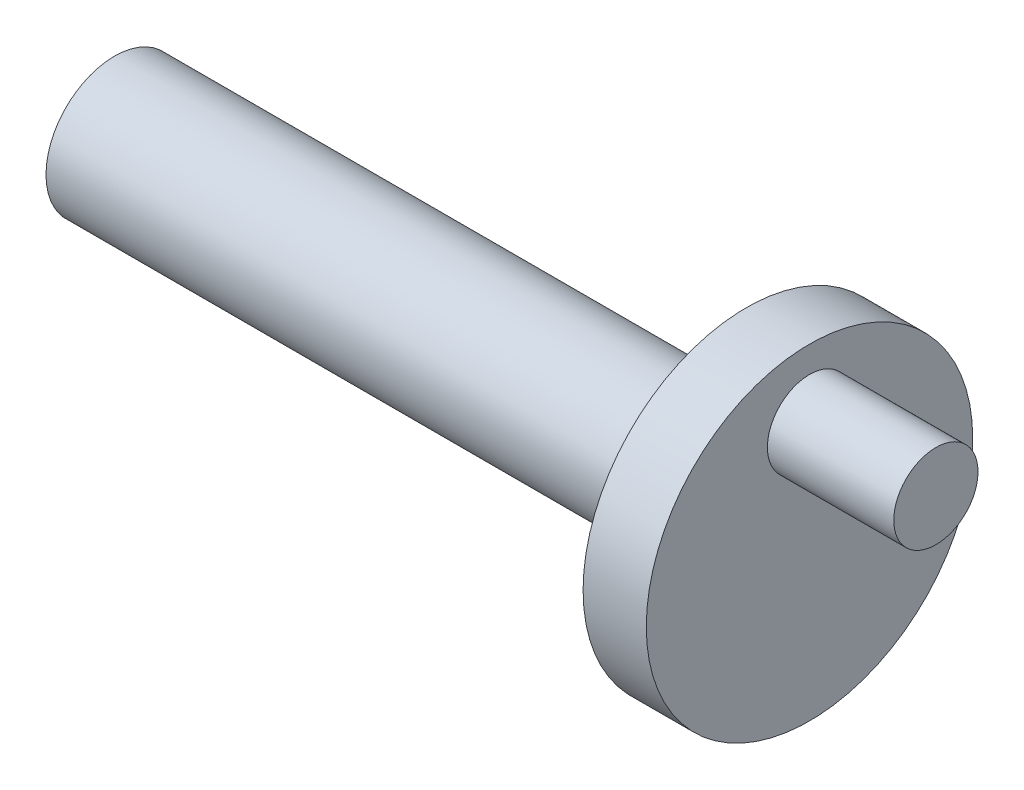
ISO-10303-21;
HEADER;
FILE_DESCRIPTION(('STEP AP214'),'2;1');
FILE_NAME('part.step','',(''),(''),'','','');
FILE_SCHEMA(('AUTOMOTIVE_DESIGN { 1 0 10303 214 1 1 1 1 }'));
ENDSEC;
DATA;
#1=APPLICATION_CONTEXT('core data for automotive mechanical design processes');
#2=APPLICATION_PROTOCOL_DEFINITION('international standard','automotive_design',2000,#1);
#3=PRODUCT_CONTEXT('',#1,'mechanical');
#4=PRODUCT('Part','Part','',(#3));
#5=PRODUCT_RELATED_PRODUCT_CATEGORY('part','',(#4));
#6=PRODUCT_DEFINITION_FORMATION('','',#4);
#7=PRODUCT_DEFINITION_CONTEXT('part definition',#1,'design');
#8=PRODUCT_DEFINITION('design','',#6,#7);
#9=PRODUCT_DEFINITION_SHAPE('','',#8);
#10=(LENGTH_UNIT() NAMED_UNIT(*) SI_UNIT(.MILLI.,.METRE.));
#11=(NAMED_UNIT(*) PLANE_ANGLE_UNIT() SI_UNIT($,.RADIAN.));
#12=(NAMED_UNIT(*) SI_UNIT($,.STERADIAN.) SOLID_ANGLE_UNIT());
#13=UNCERTAINTY_MEASURE_WITH_UNIT(LENGTH_MEASURE(1.E-05),#10,'distance_accuracy_value','');
#14=(GEOMETRIC_REPRESENTATION_CONTEXT(3) GLOBAL_UNCERTAINTY_ASSIGNED_CONTEXT((#13)) GLOBAL_UNIT_ASSIGNED_CONTEXT((#10,
#11,#12)) REPRESENTATION_CONTEXT('',''));
#15=CARTESIAN_POINT('',(0.,0.,0.));
#16=DIRECTION('',(0.,0.,1.));
#17=DIRECTION('',(1.,0.,0.));
#18=AXIS2_PLACEMENT_3D('',#15,#16,#17);
#19=CARTESIAN_POINT('',(6.,0.,0.));
#20=DIRECTION('',(-1.,0.,0.));
#21=DIRECTION('',(0.,0.,1.));
#22=AXIS2_PLACEMENT_3D('',#19,#20,#21);
#23=CYLINDRICAL_SURFACE('',#22,15.5);
#24=CARTESIAN_POINT('',(6.,0.,0.));
#25=DIRECTION('',(1.,0.,0.));
#26=DIRECTION('',(0.,0.,-1.));
#27=AXIS2_PLACEMENT_3D('',#24,#25,#26);
#28=CIRCLE('',#27,15.5);
#29=CARTESIAN_POINT('',(6.,0.,-15.5));
#30=VERTEX_POINT('',#29);
#31=EDGE_CURVE('E59',#30,#30,#28,.T.);
#32=ORIENTED_EDGE('',*,*,#31,.F.);
#33=EDGE_LOOP('',(#32));
#34=FACE_BOUND('',#33,.T.);
#35=CARTESIAN_POINT('',(0.,0.,0.));
#36=DIRECTION('',(1.,0.,0.));
#37=DIRECTION('',(0.,0.,-1.));
#38=AXIS2_PLACEMENT_3D('',#35,#36,#37);
#39=CIRCLE('',#38,15.5);
#40=CARTESIAN_POINT('',(0.,0.,-15.5));
#41=VERTEX_POINT('',#40);
#42=EDGE_CURVE('E63',#41,#41,#39,.T.);
#43=ORIENTED_EDGE('',*,*,#42,.T.);
#44=EDGE_LOOP('',(#43));
#45=FACE_BOUND('',#44,.T.);
#46=ADVANCED_FACE('F48',(#34,#45),#23,.T.);
#47=CARTESIAN_POINT('',(6.,0.,0.));
#48=DIRECTION('',(1.,0.,0.));
#49=DIRECTION('',(0.,0.,-1.));
#50=AXIS2_PLACEMENT_3D('',#47,#48,#49);
#51=PLANE('',#50);
#52=CARTESIAN_POINT('',(6.,9.,0.));
#53=DIRECTION('',(1.,0.,0.));
#54=DIRECTION('',(0.,0.,-1.));
#55=AXIS2_PLACEMENT_3D('',#52,#53,#54);
#56=CIRCLE('',#55,4.);
#57=CARTESIAN_POINT('',(6.,9.,-4.));
#58=VERTEX_POINT('',#57);
#59=EDGE_CURVE('E72',#58,#58,#56,.T.);
#60=ORIENTED_EDGE('',*,*,#59,.F.);
#61=EDGE_LOOP('',(#60));
#62=FACE_BOUND('',#61,.T.);
#63=ORIENTED_EDGE('',*,*,#31,.T.);
#64=EDGE_LOOP('',(#63));
#65=FACE_BOUND('',#64,.T.);
#66=ADVANCED_FACE('F86',(#62,#65),#51,.T.);
#67=CARTESIAN_POINT('',(0.,0.,0.));
#68=DIRECTION('',(1.,0.,0.));
#69=DIRECTION('',(0.,0.,-1.));
#70=AXIS2_PLACEMENT_3D('',#67,#68,#69);
#71=PLANE('',#70);
#72=CARTESIAN_POINT('',(0.,-0.321626652836651,0.));
#73=DIRECTION('',(1.,0.,0.));
#74=DIRECTION('',(0.,0.,-1.));
#75=AXIS2_PLACEMENT_3D('',#72,#73,#74);
#76=CIRCLE('',#75,7.5);
#77=CARTESIAN_POINT('',(0.,-0.321626652836651,-7.5));
#78=VERTEX_POINT('',#77);
#79=EDGE_CURVE('E12',#78,#78,#76,.T.);
#80=ORIENTED_EDGE('',*,*,#79,.T.);
#81=EDGE_LOOP('',(#80));
#82=FACE_BOUND('',#81,.T.);
#83=ORIENTED_EDGE('',*,*,#42,.F.);
#84=EDGE_LOOP('',(#83));
#85=FACE_BOUND('',#84,.T.);
#86=ADVANCED_FACE('F89',(#82,#85),#71,.F.);
#87=CARTESIAN_POINT('',(-60.,-0.321626652836651,0.));
#88=DIRECTION('',(1.,0.,0.));
#89=DIRECTION('',(0.,0.,-1.));
#90=AXIS2_PLACEMENT_3D('',#87,#88,#89);
#91=CYLINDRICAL_SURFACE('',#90,6.5);
#92=CARTESIAN_POINT('',(-1.,-0.321626652836651,0.));
#93=DIRECTION('',(1.,0.,0.));
#94=DIRECTION('',(0.,0.,-1.));
#95=AXIS2_PLACEMENT_3D('',#92,#93,#94);
#96=CIRCLE('',#95,6.5);
#97=CARTESIAN_POINT('',(-1.,-0.321626652836651,-6.5));
#98=VERTEX_POINT('',#97);
#99=EDGE_CURVE('E55',#98,#98,#96,.F.);
#100=ORIENTED_EDGE('',*,*,#99,.T.);
#101=EDGE_LOOP('',(#100));
#102=FACE_BOUND('',#101,.T.);
#103=CARTESIAN_POINT('',(-60.,-0.321626652836651,0.));
#104=DIRECTION('',(-1.,0.,0.));
#105=DIRECTION('',(0.,0.,1.));
#106=AXIS2_PLACEMENT_3D('',#103,#104,#105);
#107=CIRCLE('',#106,6.5);
#108=CARTESIAN_POINT('',(-60.,-0.321626652836651,6.5));
#109=VERTEX_POINT('',#108);
#110=EDGE_CURVE('E67',#109,#109,#107,.T.);
#111=ORIENTED_EDGE('',*,*,#110,.F.);
#112=EDGE_LOOP('',(#111));
#113=FACE_BOUND('',#112,.T.);
#114=ADVANCED_FACE('F98',(#102,#113),#91,.T.);
#115=CARTESIAN_POINT('',(-60.,-0.321626652836651,0.));
#116=DIRECTION('',(-1.,0.,0.));
#117=DIRECTION('',(0.,0.,1.));
#118=AXIS2_PLACEMENT_3D('',#115,#116,#117);
#119=PLANE('',#118);
#120=ORIENTED_EDGE('',*,*,#110,.T.);
#121=EDGE_LOOP('',(#120));
#122=FACE_BOUND('',#121,.T.);
#123=ADVANCED_FACE('F103',(#122),#119,.T.);
#124=CARTESIAN_POINT('',(-1.,-0.321626652836651,0.));
#125=DIRECTION('',(1.,0.,0.));
#126=DIRECTION('',(0.,0.,-1.));
#127=AXIS2_PLACEMENT_3D('',#124,#125,#126);
#128=TOROIDAL_SURFACE('',#127,7.5,1.);
#129=ORIENTED_EDGE('',*,*,#79,.F.);
#130=EDGE_LOOP('',(#129));
#131=FACE_BOUND('',#130,.T.);
#132=ORIENTED_EDGE('',*,*,#99,.F.);
#133=EDGE_LOOP('',(#132));
#134=FACE_BOUND('',#133,.T.);
#135=ADVANCED_FACE('F50',(#131,#134),#128,.F.);
#136=CARTESIAN_POINT('',(18.,9.,0.));
#137=DIRECTION('',(-1.,0.,0.));
#138=DIRECTION('',(0.,0.,1.));
#139=AXIS2_PLACEMENT_3D('',#136,#137,#138);
#140=CYLINDRICAL_SURFACE('',#139,4.);
#141=CARTESIAN_POINT('',(18.,9.,0.));
#142=DIRECTION('',(1.,0.,0.));
#143=DIRECTION('',(0.,0.,-1.));
#144=AXIS2_PLACEMENT_3D('',#141,#142,#143);
#145=CIRCLE('',#144,4.);
#146=CARTESIAN_POINT('',(18.,9.,-4.));
#147=VERTEX_POINT('',#146);
#148=EDGE_CURVE('E71',#147,#147,#145,.T.);
#149=ORIENTED_EDGE('',*,*,#148,.F.);
#150=EDGE_LOOP('',(#149));
#151=FACE_BOUND('',#150,.T.);
#152=ORIENTED_EDGE('',*,*,#59,.T.);
#153=EDGE_LOOP('',(#152));
#154=FACE_BOUND('',#153,.T.);
#155=ADVANCED_FACE('F80',(#151,#154),#140,.T.);
#156=CARTESIAN_POINT('',(18.,9.,0.));
#157=DIRECTION('',(1.,0.,0.));
#158=DIRECTION('',(0.,0.,-1.));
#159=AXIS2_PLACEMENT_3D('',#156,#157,#158);
#160=PLANE('',#159);
#161=ORIENTED_EDGE('',*,*,#148,.T.);
#162=EDGE_LOOP('',(#161));
#163=FACE_BOUND('',#162,.T.);
#164=ADVANCED_FACE('F78',(#163),#160,.T.);
#165=CLOSED_SHELL('',(#46,#66,#86,#114,#123,#135,#155,#164));
#166=MANIFOLD_SOLID_BREP('B2',#165);
#167=ADVANCED_BREP_SHAPE_REPRESENTATION('',(#18,#166),#14);
#168=SHAPE_DEFINITION_REPRESENTATION(#9,#167);
ENDSEC;
END-ISO-10303-21;
